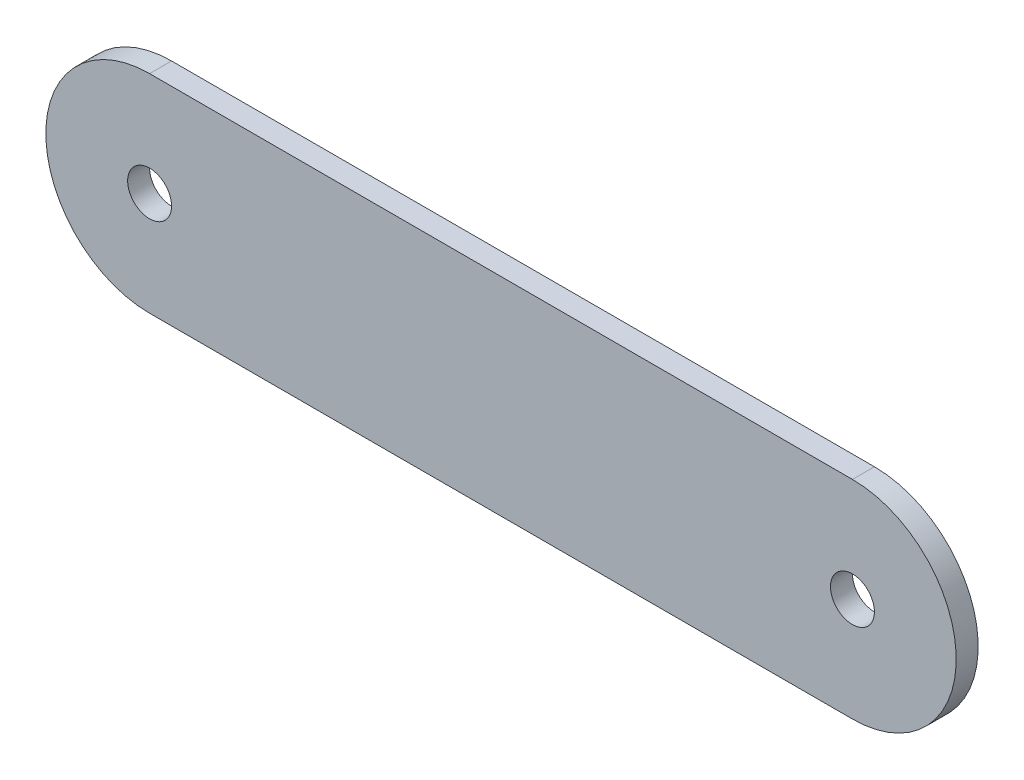
ISO-10303-21;
HEADER;
FILE_DESCRIPTION(('STEP AP214'),'2;1');
FILE_NAME('part.step','',(''),(''),'','','');
FILE_SCHEMA(('AUTOMOTIVE_DESIGN { 1 0 10303 214 1 1 1 1 }'));
ENDSEC;
DATA;
#1=APPLICATION_CONTEXT('core data for automotive mechanical design processes');
#2=APPLICATION_PROTOCOL_DEFINITION('international standard','automotive_design',2000,#1);
#3=PRODUCT_CONTEXT('',#1,'mechanical');
#4=PRODUCT('Part','Part','',(#3));
#5=PRODUCT_RELATED_PRODUCT_CATEGORY('part','',(#4));
#6=PRODUCT_DEFINITION_FORMATION('','',#4);
#7=PRODUCT_DEFINITION_CONTEXT('part definition',#1,'design');
#8=PRODUCT_DEFINITION('design','',#6,#7);
#9=PRODUCT_DEFINITION_SHAPE('','',#8);
#10=(LENGTH_UNIT() NAMED_UNIT(*) SI_UNIT(.MILLI.,.METRE.));
#11=(NAMED_UNIT(*) PLANE_ANGLE_UNIT() SI_UNIT($,.RADIAN.));
#12=(NAMED_UNIT(*) SI_UNIT($,.STERADIAN.) SOLID_ANGLE_UNIT());
#13=UNCERTAINTY_MEASURE_WITH_UNIT(LENGTH_MEASURE(1.E-05),#10,'distance_accuracy_value','');
#14=(GEOMETRIC_REPRESENTATION_CONTEXT(3) GLOBAL_UNCERTAINTY_ASSIGNED_CONTEXT((#13)) GLOBAL_UNIT_ASSIGNED_CONTEXT((#10,
#11,#12)) REPRESENTATION_CONTEXT('',''));
#15=CARTESIAN_POINT('',(0.,0.,0.));
#16=DIRECTION('',(0.,0.,1.));
#17=DIRECTION('',(1.,0.,0.));
#18=AXIS2_PLACEMENT_3D('',#15,#16,#17);
#19=CARTESIAN_POINT('',(-101.6,0.,3.175));
#20=DIRECTION('',(0.,0.,1.));
#21=DIRECTION('',(1.,0.,0.));
#22=AXIS2_PLACEMENT_3D('',#19,#20,#21);
#23=PLANE('',#22);
#24=CARTESIAN_POINT('',(-101.6,0.,3.175));
#25=DIRECTION('',(0.,0.,1.));
#26=DIRECTION('',(1.,0.,0.));
#27=AXIS2_PLACEMENT_3D('',#24,#25,#26);
#28=CIRCLE('',#27,6.35);
#29=CARTESIAN_POINT('',(-95.25,0.,3.175));
#30=VERTEX_POINT('',#29);
#31=EDGE_CURVE('E112',#30,#30,#28,.T.);
#32=ORIENTED_EDGE('',*,*,#31,.F.);
#33=EDGE_LOOP('',(#32));
#34=FACE_BOUND('',#33,.T.);
#35=CARTESIAN_POINT('',(-101.6,0.,3.175));
#36=DIRECTION('',(0.,0.,1.));
#37=DIRECTION('',(1.,0.,0.));
#38=AXIS2_PLACEMENT_3D('',#35,#36,#37);
#39=CIRCLE('',#38,30.);
#40=CARTESIAN_POINT('',(-101.6,30.,3.175));
#41=VERTEX_POINT('',#40);
#42=CARTESIAN_POINT('',(-101.6,-30.,3.175));
#43=VERTEX_POINT('',#42);
#44=EDGE_CURVE('E92',#41,#43,#39,.T.);
#45=ORIENTED_EDGE('',*,*,#44,.T.);
#46=DIRECTION('',(1.,0.,0.));
#47=VECTOR('',#46,1.);
#48=CARTESIAN_POINT('',(-101.6,-30.,3.175));
#49=LINE('',#48,#47);
#50=CARTESIAN_POINT('',(101.6,-30.,3.175));
#51=VERTEX_POINT('',#50);
#52=EDGE_CURVE('E87',#43,#51,#49,.T.);
#53=ORIENTED_EDGE('',*,*,#52,.T.);
#54=CARTESIAN_POINT('',(101.6,0.,3.175));
#55=DIRECTION('',(0.,0.,1.));
#56=DIRECTION('',(1.,0.,0.));
#57=AXIS2_PLACEMENT_3D('',#54,#55,#56);
#58=CIRCLE('',#57,30.);
#59=CARTESIAN_POINT('',(101.6,30.,3.175));
#60=VERTEX_POINT('',#59);
#61=EDGE_CURVE('E90',#51,#60,#58,.T.);
#62=ORIENTED_EDGE('',*,*,#61,.T.);
#63=DIRECTION('',(-1.,0.,0.));
#64=VECTOR('',#63,1.);
#65=CARTESIAN_POINT('',(-101.6,30.,3.175));
#66=LINE('',#65,#64);
#67=EDGE_CURVE('E57',#60,#41,#66,.T.);
#68=ORIENTED_EDGE('',*,*,#67,.T.);
#69=EDGE_LOOP('',(#45,#53,#62,#68));
#70=FACE_BOUND('',#69,.T.);
#71=CARTESIAN_POINT('',(101.6,0.,3.175));
#72=DIRECTION('',(0.,0.,1.));
#73=DIRECTION('',(-1.,0.,0.));
#74=AXIS2_PLACEMENT_3D('',#71,#72,#73);
#75=CIRCLE('',#74,6.35);
#76=CARTESIAN_POINT('',(95.25,0.,3.175));
#77=VERTEX_POINT('',#76);
#78=EDGE_CURVE('E134',#77,#77,#75,.T.);
#79=ORIENTED_EDGE('',*,*,#78,.F.);
#80=EDGE_LOOP('',(#79));
#81=FACE_BOUND('',#80,.T.);
#82=ADVANCED_FACE('F39',(#34,#70,#81),#23,.T.);
#83=CARTESIAN_POINT('',(-101.6,0.,-3.175));
#84=DIRECTION('',(0.,0.,1.));
#85=DIRECTION('',(1.,0.,0.));
#86=AXIS2_PLACEMENT_3D('',#83,#84,#85);
#87=PLANE('',#86);
#88=CARTESIAN_POINT('',(-101.6,0.,-3.175));
#89=DIRECTION('',(0.,0.,1.));
#90=DIRECTION('',(1.,0.,0.));
#91=AXIS2_PLACEMENT_3D('',#88,#89,#90);
#92=CIRCLE('',#91,30.);
#93=CARTESIAN_POINT('',(-101.6,30.,-3.175));
#94=VERTEX_POINT('',#93);
#95=CARTESIAN_POINT('',(-101.6,-30.,-3.175));
#96=VERTEX_POINT('',#95);
#97=EDGE_CURVE('E108',#94,#96,#92,.T.);
#98=ORIENTED_EDGE('',*,*,#97,.F.);
#99=DIRECTION('',(-1.,0.,0.));
#100=VECTOR('',#99,1.);
#101=CARTESIAN_POINT('',(-101.6,30.,-3.175));
#102=LINE('',#101,#100);
#103=CARTESIAN_POINT('',(101.6,30.,-3.175));
#104=VERTEX_POINT('',#103);
#105=EDGE_CURVE('E80',#104,#94,#102,.T.);
#106=ORIENTED_EDGE('',*,*,#105,.F.);
#107=CARTESIAN_POINT('',(101.6,0.,-3.175));
#108=DIRECTION('',(0.,0.,1.));
#109=DIRECTION('',(1.,0.,0.));
#110=AXIS2_PLACEMENT_3D('',#107,#108,#109);
#111=CIRCLE('',#110,30.);
#112=CARTESIAN_POINT('',(101.6,-30.,-3.175));
#113=VERTEX_POINT('',#112);
#114=EDGE_CURVE('E74',#113,#104,#111,.T.);
#115=ORIENTED_EDGE('',*,*,#114,.F.);
#116=DIRECTION('',(1.,0.,0.));
#117=VECTOR('',#116,1.);
#118=CARTESIAN_POINT('',(-101.6,-30.,-3.175));
#119=LINE('',#118,#117);
#120=EDGE_CURVE('E97',#96,#113,#119,.T.);
#121=ORIENTED_EDGE('',*,*,#120,.F.);
#122=EDGE_LOOP('',(#98,#106,#115,#121));
#123=FACE_BOUND('',#122,.T.);
#124=CARTESIAN_POINT('',(-101.6,0.,-3.175));
#125=DIRECTION('',(0.,0.,1.));
#126=DIRECTION('',(1.,0.,0.));
#127=AXIS2_PLACEMENT_3D('',#124,#125,#126);
#128=CIRCLE('',#127,6.35);
#129=CARTESIAN_POINT('',(-95.25,0.,-3.175));
#130=VERTEX_POINT('',#129);
#131=EDGE_CURVE('E130',#130,#130,#128,.T.);
#132=ORIENTED_EDGE('',*,*,#131,.T.);
#133=EDGE_LOOP('',(#132));
#134=FACE_BOUND('',#133,.T.);
#135=CARTESIAN_POINT('',(101.6,0.,-3.175));
#136=DIRECTION('',(0.,0.,1.));
#137=DIRECTION('',(-1.,0.,0.));
#138=AXIS2_PLACEMENT_3D('',#135,#136,#137);
#139=CIRCLE('',#138,6.35);
#140=CARTESIAN_POINT('',(95.25,0.,-3.175));
#141=VERTEX_POINT('',#140);
#142=EDGE_CURVE('E138',#141,#141,#139,.T.);
#143=ORIENTED_EDGE('',*,*,#142,.T.);
#144=EDGE_LOOP('',(#143));
#145=FACE_BOUND('',#144,.T.);
#146=ADVANCED_FACE('F125',(#123,#134,#145),#87,.F.);
#147=CARTESIAN_POINT('',(-101.6,0.,3.175));
#148=DIRECTION('',(0.,0.,-1.));
#149=DIRECTION('',(-1.,0.,0.));
#150=AXIS2_PLACEMENT_3D('',#147,#148,#149);
#151=CYLINDRICAL_SURFACE('',#150,30.);
#152=ORIENTED_EDGE('',*,*,#97,.T.);
#153=DIRECTION('',(0.,0.,-1.));
#154=VECTOR('',#153,1.);
#155=CARTESIAN_POINT('',(-101.6,-30.,3.175));
#156=LINE('',#155,#154);
#157=EDGE_CURVE('E11',#43,#96,#156,.T.);
#158=ORIENTED_EDGE('',*,*,#157,.F.);
#159=ORIENTED_EDGE('',*,*,#44,.F.);
#160=DIRECTION('',(0.,0.,-1.));
#161=VECTOR('',#160,1.);
#162=CARTESIAN_POINT('',(-101.6,30.,3.175));
#163=LINE('',#162,#161);
#164=EDGE_CURVE('E104',#41,#94,#163,.T.);
#165=ORIENTED_EDGE('',*,*,#164,.T.);
#166=EDGE_LOOP('',(#152,#158,#159,#165));
#167=FACE_BOUND('',#166,.T.);
#168=ADVANCED_FACE('F41',(#167),#151,.T.);
#169=CARTESIAN_POINT('',(-101.6,-30.,3.175));
#170=DIRECTION('',(0.,1.,0.));
#171=DIRECTION('',(-1.,0.,0.));
#172=AXIS2_PLACEMENT_3D('',#169,#170,#171);
#173=PLANE('',#172);
#174=ORIENTED_EDGE('',*,*,#120,.T.);
#175=DIRECTION('',(0.,0.,-1.));
#176=VECTOR('',#175,1.);
#177=CARTESIAN_POINT('',(101.6,-30.,3.175));
#178=LINE('',#177,#176);
#179=EDGE_CURVE('E49',#51,#113,#178,.T.);
#180=ORIENTED_EDGE('',*,*,#179,.F.);
#181=ORIENTED_EDGE('',*,*,#52,.F.);
#182=ORIENTED_EDGE('',*,*,#157,.T.);
#183=EDGE_LOOP('',(#174,#180,#181,#182));
#184=FACE_BOUND('',#183,.T.);
#185=ADVANCED_FACE('F96',(#184),#173,.F.);
#186=CARTESIAN_POINT('',(101.6,0.,3.175));
#187=DIRECTION('',(0.,0.,-1.));
#188=DIRECTION('',(-1.,0.,0.));
#189=AXIS2_PLACEMENT_3D('',#186,#187,#188);
#190=CYLINDRICAL_SURFACE('',#189,30.);
#191=ORIENTED_EDGE('',*,*,#114,.T.);
#192=DIRECTION('',(0.,0.,-1.));
#193=VECTOR('',#192,1.);
#194=CARTESIAN_POINT('',(101.6,30.,3.175));
#195=LINE('',#194,#193);
#196=EDGE_CURVE('E99',#60,#104,#195,.T.);
#197=ORIENTED_EDGE('',*,*,#196,.F.);
#198=ORIENTED_EDGE('',*,*,#61,.F.);
#199=ORIENTED_EDGE('',*,*,#179,.T.);
#200=EDGE_LOOP('',(#191,#197,#198,#199));
#201=FACE_BOUND('',#200,.T.);
#202=ADVANCED_FACE('F100',(#201),#190,.T.);
#203=CARTESIAN_POINT('',(-101.6,30.,3.175));
#204=DIRECTION('',(0.,-1.,0.));
#205=DIRECTION('',(1.,0.,0.));
#206=AXIS2_PLACEMENT_3D('',#203,#204,#205);
#207=PLANE('',#206);
#208=ORIENTED_EDGE('',*,*,#105,.T.);
#209=ORIENTED_EDGE('',*,*,#164,.F.);
#210=ORIENTED_EDGE('',*,*,#67,.F.);
#211=ORIENTED_EDGE('',*,*,#196,.T.);
#212=EDGE_LOOP('',(#208,#209,#210,#211));
#213=FACE_BOUND('',#212,.T.);
#214=ADVANCED_FACE('F122',(#213),#207,.F.);
#215=CARTESIAN_POINT('',(-101.6,0.,3.175));
#216=DIRECTION('',(0.,0.,-1.));
#217=DIRECTION('',(-1.,0.,0.));
#218=AXIS2_PLACEMENT_3D('',#215,#216,#217);
#219=CYLINDRICAL_SURFACE('',#218,6.35);
#220=ORIENTED_EDGE('',*,*,#31,.T.);
#221=EDGE_LOOP('',(#220));
#222=FACE_BOUND('',#221,.T.);
#223=ORIENTED_EDGE('',*,*,#131,.F.);
#224=EDGE_LOOP('',(#223));
#225=FACE_BOUND('',#224,.T.);
#226=ADVANCED_FACE('F157',(#222,#225),#219,.F.);
#227=CARTESIAN_POINT('',(101.6,0.,3.175));
#228=DIRECTION('',(0.,0.,-1.));
#229=DIRECTION('',(-1.,0.,0.));
#230=AXIS2_PLACEMENT_3D('',#227,#228,#229);
#231=CYLINDRICAL_SURFACE('',#230,6.35);
#232=ORIENTED_EDGE('',*,*,#78,.T.);
#233=EDGE_LOOP('',(#232));
#234=FACE_BOUND('',#233,.T.);
#235=ORIENTED_EDGE('',*,*,#142,.F.);
#236=EDGE_LOOP('',(#235));
#237=FACE_BOUND('',#236,.T.);
#238=ADVANCED_FACE('F146',(#234,#237),#231,.F.);
#239=CLOSED_SHELL('',(#82,#146,#168,#185,#202,#214,#226,#238));
#240=MANIFOLD_SOLID_BREP('B2',#239);
#241=ADVANCED_BREP_SHAPE_REPRESENTATION('',(#18,#240),#14);
#242=SHAPE_DEFINITION_REPRESENTATION(#9,#241);
ENDSEC;
END-ISO-10303-21;
